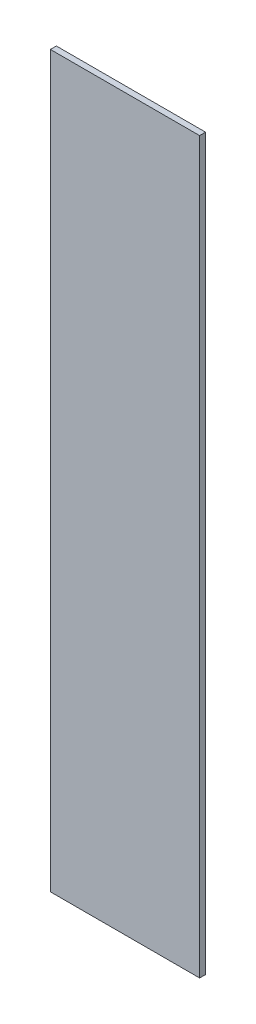
ISO-10303-21;
HEADER;
FILE_DESCRIPTION(('STEP AP214'),'2;1');
FILE_NAME('part.step','',(''),(''),'','','');
FILE_SCHEMA(('AUTOMOTIVE_DESIGN { 1 0 10303 214 1 1 1 1 }'));
ENDSEC;
DATA;
#1=APPLICATION_CONTEXT('core data for automotive mechanical design processes');
#2=APPLICATION_PROTOCOL_DEFINITION('international standard','automotive_design',2000,#1);
#3=PRODUCT_CONTEXT('',#1,'mechanical');
#4=PRODUCT('Part','Part','',(#3));
#5=PRODUCT_RELATED_PRODUCT_CATEGORY('part','',(#4));
#6=PRODUCT_DEFINITION_FORMATION('','',#4);
#7=PRODUCT_DEFINITION_CONTEXT('part definition',#1,'design');
#8=PRODUCT_DEFINITION('design','',#6,#7);
#9=PRODUCT_DEFINITION_SHAPE('','',#8);
#10=(LENGTH_UNIT() NAMED_UNIT(*) SI_UNIT(.MILLI.,.METRE.));
#11=(NAMED_UNIT(*) PLANE_ANGLE_UNIT() SI_UNIT($,.RADIAN.));
#12=(NAMED_UNIT(*) SI_UNIT($,.STERADIAN.) SOLID_ANGLE_UNIT());
#13=UNCERTAINTY_MEASURE_WITH_UNIT(LENGTH_MEASURE(1.E-05),#10,'distance_accuracy_value','');
#14=(GEOMETRIC_REPRESENTATION_CONTEXT(3) GLOBAL_UNCERTAINTY_ASSIGNED_CONTEXT((#13)) GLOBAL_UNIT_ASSIGNED_CONTEXT((#10,
#11,#12)) REPRESENTATION_CONTEXT('',''));
#15=CARTESIAN_POINT('',(0.,0.,0.));
#16=DIRECTION('',(0.,0.,1.));
#17=DIRECTION('',(1.,0.,0.));
#18=AXIS2_PLACEMENT_3D('',#15,#16,#17);
#19=CARTESIAN_POINT('',(0.,0.,18.));
#20=DIRECTION('',(1.,0.,0.));
#21=DIRECTION('',(0.,0.,-1.));
#22=AXIS2_PLACEMENT_3D('',#19,#20,#21);
#23=PLANE('',#22);
#24=DIRECTION('',(0.,-1.,0.));
#25=VECTOR('',#24,1.);
#26=CARTESIAN_POINT('',(0.,0.,0.));
#27=LINE('',#26,#25);
#28=CARTESIAN_POINT('',(0.,2200.,0.));
#29=VERTEX_POINT('',#28);
#30=CARTESIAN_POINT('',(0.,0.,0.));
#31=VERTEX_POINT('',#30);
#32=EDGE_CURVE('E96',#29,#31,#27,.T.);
#33=ORIENTED_EDGE('',*,*,#32,.T.);
#34=DIRECTION('',(0.,0.,-1.));
#35=VECTOR('',#34,1.);
#36=CARTESIAN_POINT('',(0.,0.,18.));
#37=LINE('',#36,#35);
#38=CARTESIAN_POINT('',(0.,0.,18.));
#39=VERTEX_POINT('',#38);
#40=EDGE_CURVE('E11',#39,#31,#37,.T.);
#41=ORIENTED_EDGE('',*,*,#40,.F.);
#42=DIRECTION('',(0.,-1.,0.));
#43=VECTOR('',#42,1.);
#44=CARTESIAN_POINT('',(0.,0.,18.));
#45=LINE('',#44,#43);
#46=CARTESIAN_POINT('',(0.,2200.,18.));
#47=VERTEX_POINT('',#46);
#48=EDGE_CURVE('E84',#47,#39,#45,.T.);
#49=ORIENTED_EDGE('',*,*,#48,.F.);
#50=DIRECTION('',(0.,0.,-1.));
#51=VECTOR('',#50,1.);
#52=CARTESIAN_POINT('',(0.,2200.,18.));
#53=LINE('',#52,#51);
#54=EDGE_CURVE('E92',#47,#29,#53,.T.);
#55=ORIENTED_EDGE('',*,*,#54,.T.);
#56=EDGE_LOOP('',(#33,#41,#49,#55));
#57=FACE_BOUND('',#56,.T.);
#58=ADVANCED_FACE('F33',(#57),#23,.F.);
#59=CARTESIAN_POINT('',(0.,0.,18.));
#60=DIRECTION('',(0.,1.,0.));
#61=DIRECTION('',(0.,0.,1.));
#62=AXIS2_PLACEMENT_3D('',#59,#60,#61);
#63=PLANE('',#62);
#64=DIRECTION('',(1.,0.,0.));
#65=VECTOR('',#64,1.);
#66=CARTESIAN_POINT('',(0.,0.,0.));
#67=LINE('',#66,#65);
#68=CARTESIAN_POINT('',(450.,0.,0.));
#69=VERTEX_POINT('',#68);
#70=EDGE_CURVE('E88',#31,#69,#67,.T.);
#71=ORIENTED_EDGE('',*,*,#70,.T.);
#72=DIRECTION('',(0.,0.,-1.));
#73=VECTOR('',#72,1.);
#74=CARTESIAN_POINT('',(450.,0.,18.));
#75=LINE('',#74,#73);
#76=CARTESIAN_POINT('',(450.,0.,18.));
#77=VERTEX_POINT('',#76);
#78=EDGE_CURVE('E41',#77,#69,#75,.T.);
#79=ORIENTED_EDGE('',*,*,#78,.F.);
#80=DIRECTION('',(1.,0.,0.));
#81=VECTOR('',#80,1.);
#82=CARTESIAN_POINT('',(0.,0.,18.));
#83=LINE('',#82,#81);
#84=EDGE_CURVE('E79',#39,#77,#83,.T.);
#85=ORIENTED_EDGE('',*,*,#84,.F.);
#86=ORIENTED_EDGE('',*,*,#40,.T.);
#87=EDGE_LOOP('',(#71,#79,#85,#86));
#88=FACE_BOUND('',#87,.T.);
#89=ADVANCED_FACE('F87',(#88),#63,.F.);
#90=CARTESIAN_POINT('',(450.,0.,18.));
#91=DIRECTION('',(-1.,0.,0.));
#92=DIRECTION('',(0.,0.,1.));
#93=AXIS2_PLACEMENT_3D('',#90,#91,#92);
#94=PLANE('',#93);
#95=DIRECTION('',(0.,1.,0.));
#96=VECTOR('',#95,1.);
#97=CARTESIAN_POINT('',(450.,0.,0.));
#98=LINE('',#97,#96);
#99=CARTESIAN_POINT('',(450.,2200.,0.));
#100=VERTEX_POINT('',#99);
#101=EDGE_CURVE('E66',#69,#100,#98,.T.);
#102=ORIENTED_EDGE('',*,*,#101,.T.);
#103=DIRECTION('',(0.,0.,-1.));
#104=VECTOR('',#103,1.);
#105=CARTESIAN_POINT('',(450.,2200.,18.));
#106=LINE('',#105,#104);
#107=CARTESIAN_POINT('',(450.,2200.,18.));
#108=VERTEX_POINT('',#107);
#109=EDGE_CURVE('E89',#108,#100,#106,.T.);
#110=ORIENTED_EDGE('',*,*,#109,.F.);
#111=DIRECTION('',(0.,1.,0.));
#112=VECTOR('',#111,1.);
#113=CARTESIAN_POINT('',(450.,0.,18.));
#114=LINE('',#113,#112);
#115=EDGE_CURVE('E82',#77,#108,#114,.T.);
#116=ORIENTED_EDGE('',*,*,#115,.F.);
#117=ORIENTED_EDGE('',*,*,#78,.T.);
#118=EDGE_LOOP('',(#102,#110,#116,#117));
#119=FACE_BOUND('',#118,.T.);
#120=ADVANCED_FACE('F90',(#119),#94,.F.);
#121=CARTESIAN_POINT('',(0.,2200.,18.));
#122=DIRECTION('',(0.,-1.,0.));
#123=DIRECTION('',(0.,0.,-1.));
#124=AXIS2_PLACEMENT_3D('',#121,#122,#123);
#125=PLANE('',#124);
#126=DIRECTION('',(-1.,0.,0.));
#127=VECTOR('',#126,1.);
#128=CARTESIAN_POINT('',(0.,2200.,0.));
#129=LINE('',#128,#127);
#130=EDGE_CURVE('E72',#100,#29,#129,.T.);
#131=ORIENTED_EDGE('',*,*,#130,.T.);
#132=ORIENTED_EDGE('',*,*,#54,.F.);
#133=DIRECTION('',(-1.,0.,0.));
#134=VECTOR('',#133,1.);
#135=CARTESIAN_POINT('',(0.,2200.,18.));
#136=LINE('',#135,#134);
#137=EDGE_CURVE('E49',#108,#47,#136,.T.);
#138=ORIENTED_EDGE('',*,*,#137,.F.);
#139=ORIENTED_EDGE('',*,*,#109,.T.);
#140=EDGE_LOOP('',(#131,#132,#138,#139));
#141=FACE_BOUND('',#140,.T.);
#142=ADVANCED_FACE('F103',(#141),#125,.F.);
#143=CARTESIAN_POINT('',(0.,0.,18.));
#144=DIRECTION('',(0.,0.,-1.));
#145=DIRECTION('',(-1.,0.,0.));
#146=AXIS2_PLACEMENT_3D('',#143,#144,#145);
#147=PLANE('',#146);
#148=ORIENTED_EDGE('',*,*,#48,.T.);
#149=ORIENTED_EDGE('',*,*,#84,.T.);
#150=ORIENTED_EDGE('',*,*,#115,.T.);
#151=ORIENTED_EDGE('',*,*,#137,.T.);
#152=EDGE_LOOP('',(#148,#149,#150,#151));
#153=FACE_BOUND('',#152,.T.);
#154=ADVANCED_FACE('F80',(#153),#147,.F.);
#155=CARTESIAN_POINT('',(0.,0.,0.));
#156=DIRECTION('',(0.,0.,-1.));
#157=DIRECTION('',(-1.,0.,0.));
#158=AXIS2_PLACEMENT_3D('',#155,#156,#157);
#159=PLANE('',#158);
#160=ORIENTED_EDGE('',*,*,#32,.F.);
#161=ORIENTED_EDGE('',*,*,#130,.F.);
#162=ORIENTED_EDGE('',*,*,#101,.F.);
#163=ORIENTED_EDGE('',*,*,#70,.F.);
#164=EDGE_LOOP('',(#160,#161,#162,#163));
#165=FACE_BOUND('',#164,.T.);
#166=ADVANCED_FACE('F106',(#165),#159,.T.);
#167=CLOSED_SHELL('',(#58,#89,#120,#142,#154,#166));
#168=MANIFOLD_SOLID_BREP('B2',#167);
#169=ADVANCED_BREP_SHAPE_REPRESENTATION('',(#18,#168),#14);
#170=SHAPE_DEFINITION_REPRESENTATION(#9,#169);
ENDSEC;
END-ISO-10303-21;
